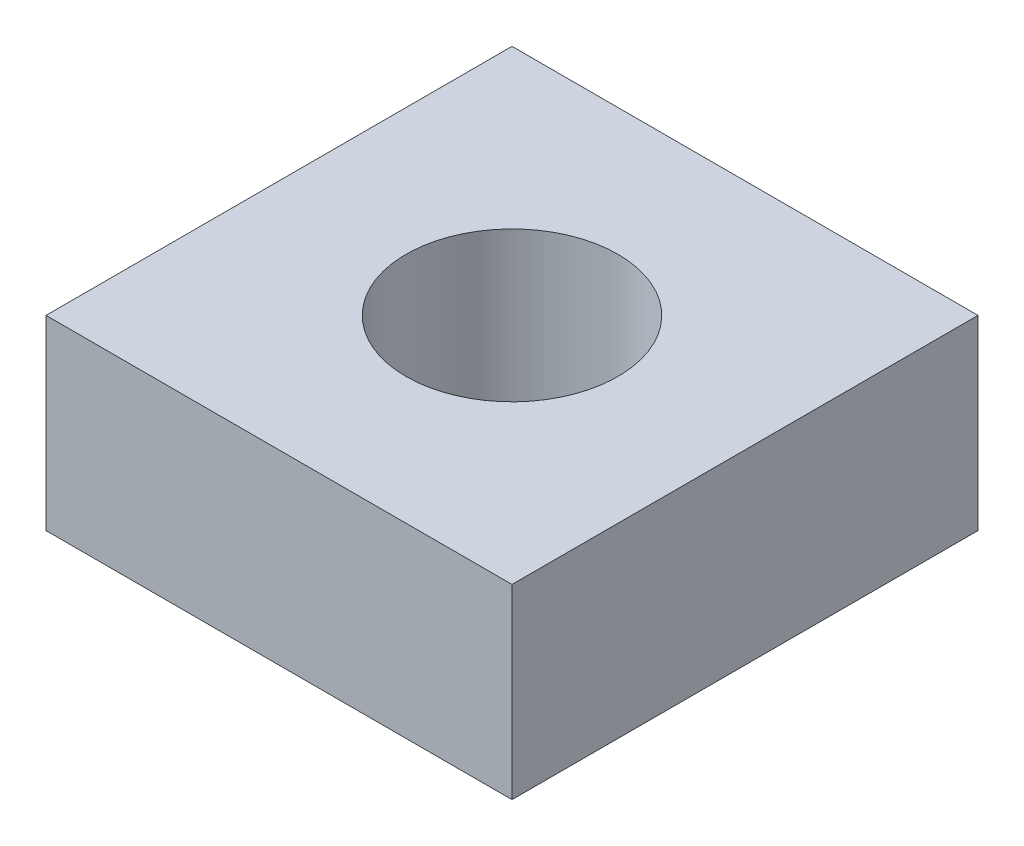
ISO-10303-21;
HEADER;
FILE_DESCRIPTION(('STEP AP214'),'2;1');
FILE_NAME('part.step','',(''),(''),'','','');
FILE_SCHEMA(('AUTOMOTIVE_DESIGN { 1 0 10303 214 1 1 1 1 }'));
ENDSEC;
DATA;
#1=APPLICATION_CONTEXT('core data for automotive mechanical design processes');
#2=APPLICATION_PROTOCOL_DEFINITION('international standard','automotive_design',2000,#1);
#3=PRODUCT_CONTEXT('',#1,'mechanical');
#4=PRODUCT('Part','Part','',(#3));
#5=PRODUCT_RELATED_PRODUCT_CATEGORY('part','',(#4));
#6=PRODUCT_DEFINITION_FORMATION('','',#4);
#7=PRODUCT_DEFINITION_CONTEXT('part definition',#1,'design');
#8=PRODUCT_DEFINITION('design','',#6,#7);
#9=PRODUCT_DEFINITION_SHAPE('','',#8);
#10=(LENGTH_UNIT() NAMED_UNIT(*) SI_UNIT(.MILLI.,.METRE.));
#11=(NAMED_UNIT(*) PLANE_ANGLE_UNIT() SI_UNIT($,.RADIAN.));
#12=(NAMED_UNIT(*) SI_UNIT($,.STERADIAN.) SOLID_ANGLE_UNIT());
#13=UNCERTAINTY_MEASURE_WITH_UNIT(LENGTH_MEASURE(1.E-05),#10,'distance_accuracy_value','');
#14=(GEOMETRIC_REPRESENTATION_CONTEXT(3) GLOBAL_UNCERTAINTY_ASSIGNED_CONTEXT((#13)) GLOBAL_UNIT_ASSIGNED_CONTEXT((#10,
#11,#12)) REPRESENTATION_CONTEXT('',''));
#15=CARTESIAN_POINT('',(0.,0.,0.));
#16=DIRECTION('',(0.,0.,1.));
#17=DIRECTION('',(1.,0.,0.));
#18=AXIS2_PLACEMENT_3D('',#15,#16,#17);
#19=CARTESIAN_POINT('',(2.75,2.2,-2.75));
#20=DIRECTION('',(-1.,0.,0.));
#21=DIRECTION('',(0.,0.,1.));
#22=AXIS2_PLACEMENT_3D('',#19,#20,#21);
#23=PLANE('',#22);
#24=DIRECTION('',(0.,0.,-1.));
#25=VECTOR('',#24,1.);
#26=CARTESIAN_POINT('',(2.75,0.,-2.75));
#27=LINE('',#26,#25);
#28=CARTESIAN_POINT('',(2.75,0.,2.75));
#29=VERTEX_POINT('',#28);
#30=CARTESIAN_POINT('',(2.75,0.,-2.75));
#31=VERTEX_POINT('',#30);
#32=EDGE_CURVE('E110',#29,#31,#27,.T.);
#33=ORIENTED_EDGE('',*,*,#32,.T.);
#34=DIRECTION('',(0.,-1.,0.));
#35=VECTOR('',#34,1.);
#36=CARTESIAN_POINT('',(2.75,2.2,-2.75));
#37=LINE('',#36,#35);
#38=CARTESIAN_POINT('',(2.75,2.2,-2.75));
#39=VERTEX_POINT('',#38);
#40=EDGE_CURVE('E11',#39,#31,#37,.T.);
#41=ORIENTED_EDGE('',*,*,#40,.F.);
#42=DIRECTION('',(0.,0.,-1.));
#43=VECTOR('',#42,1.);
#44=CARTESIAN_POINT('',(2.75,2.2,-2.75));
#45=LINE('',#44,#43);
#46=CARTESIAN_POINT('',(2.75,2.2,2.75));
#47=VERTEX_POINT('',#46);
#48=EDGE_CURVE('E98',#47,#39,#45,.T.);
#49=ORIENTED_EDGE('',*,*,#48,.F.);
#50=DIRECTION('',(0.,-1.,0.));
#51=VECTOR('',#50,1.);
#52=CARTESIAN_POINT('',(2.75,2.2,2.75));
#53=LINE('',#52,#51);
#54=EDGE_CURVE('E106',#47,#29,#53,.T.);
#55=ORIENTED_EDGE('',*,*,#54,.T.);
#56=EDGE_LOOP('',(#33,#41,#49,#55));
#57=FACE_BOUND('',#56,.T.);
#58=ADVANCED_FACE('F47',(#57),#23,.F.);
#59=CARTESIAN_POINT('',(-2.75,2.2,-2.75));
#60=DIRECTION('',(0.,0.,1.));
#61=DIRECTION('',(1.,0.,0.));
#62=AXIS2_PLACEMENT_3D('',#59,#60,#61);
#63=PLANE('',#62);
#64=DIRECTION('',(-1.,0.,0.));
#65=VECTOR('',#64,1.);
#66=CARTESIAN_POINT('',(-2.75,0.,-2.75));
#67=LINE('',#66,#65);
#68=CARTESIAN_POINT('',(-2.75,0.,-2.75));
#69=VERTEX_POINT('',#68);
#70=EDGE_CURVE('E102',#31,#69,#67,.T.);
#71=ORIENTED_EDGE('',*,*,#70,.T.);
#72=DIRECTION('',(0.,-1.,0.));
#73=VECTOR('',#72,1.);
#74=CARTESIAN_POINT('',(-2.75,2.2,-2.75));
#75=LINE('',#74,#73);
#76=CARTESIAN_POINT('',(-2.75,2.2,-2.75));
#77=VERTEX_POINT('',#76);
#78=EDGE_CURVE('E55',#77,#69,#75,.T.);
#79=ORIENTED_EDGE('',*,*,#78,.F.);
#80=DIRECTION('',(-1.,0.,0.));
#81=VECTOR('',#80,1.);
#82=CARTESIAN_POINT('',(-2.75,2.2,-2.75));
#83=LINE('',#82,#81);
#84=EDGE_CURVE('E93',#39,#77,#83,.T.);
#85=ORIENTED_EDGE('',*,*,#84,.F.);
#86=ORIENTED_EDGE('',*,*,#40,.T.);
#87=EDGE_LOOP('',(#71,#79,#85,#86));
#88=FACE_BOUND('',#87,.T.);
#89=ADVANCED_FACE('F101',(#88),#63,.F.);
#90=CARTESIAN_POINT('',(-2.75,2.2,-2.75));
#91=DIRECTION('',(1.,0.,0.));
#92=DIRECTION('',(0.,0.,-1.));
#93=AXIS2_PLACEMENT_3D('',#90,#91,#92);
#94=PLANE('',#93);
#95=DIRECTION('',(0.,0.,1.));
#96=VECTOR('',#95,1.);
#97=CARTESIAN_POINT('',(-2.75,0.,-2.75));
#98=LINE('',#97,#96);
#99=CARTESIAN_POINT('',(-2.75,0.,2.75));
#100=VERTEX_POINT('',#99);
#101=EDGE_CURVE('E80',#69,#100,#98,.T.);
#102=ORIENTED_EDGE('',*,*,#101,.T.);
#103=DIRECTION('',(0.,-1.,0.));
#104=VECTOR('',#103,1.);
#105=CARTESIAN_POINT('',(-2.75,2.2,2.75));
#106=LINE('',#105,#104);
#107=CARTESIAN_POINT('',(-2.75,2.2,2.75));
#108=VERTEX_POINT('',#107);
#109=EDGE_CURVE('E103',#108,#100,#106,.T.);
#110=ORIENTED_EDGE('',*,*,#109,.F.);
#111=DIRECTION('',(0.,0.,1.));
#112=VECTOR('',#111,1.);
#113=CARTESIAN_POINT('',(-2.75,2.2,-2.75));
#114=LINE('',#113,#112);
#115=EDGE_CURVE('E96',#77,#108,#114,.T.);
#116=ORIENTED_EDGE('',*,*,#115,.F.);
#117=ORIENTED_EDGE('',*,*,#78,.T.);
#118=EDGE_LOOP('',(#102,#110,#116,#117));
#119=FACE_BOUND('',#118,.T.);
#120=ADVANCED_FACE('F104',(#119),#94,.F.);
#121=CARTESIAN_POINT('',(-2.75,2.2,2.75));
#122=DIRECTION('',(0.,0.,-1.));
#123=DIRECTION('',(-1.,0.,0.));
#124=AXIS2_PLACEMENT_3D('',#121,#122,#123);
#125=PLANE('',#124);
#126=DIRECTION('',(1.,0.,0.));
#127=VECTOR('',#126,1.);
#128=CARTESIAN_POINT('',(-2.75,0.,2.75));
#129=LINE('',#128,#127);
#130=EDGE_CURVE('E86',#100,#29,#129,.T.);
#131=ORIENTED_EDGE('',*,*,#130,.T.);
#132=ORIENTED_EDGE('',*,*,#54,.F.);
#133=DIRECTION('',(1.,0.,0.));
#134=VECTOR('',#133,1.);
#135=CARTESIAN_POINT('',(-2.75,2.2,2.75));
#136=LINE('',#135,#134);
#137=EDGE_CURVE('E63',#108,#47,#136,.T.);
#138=ORIENTED_EDGE('',*,*,#137,.F.);
#139=ORIENTED_EDGE('',*,*,#109,.T.);
#140=EDGE_LOOP('',(#131,#132,#138,#139));
#141=FACE_BOUND('',#140,.T.);
#142=ADVANCED_FACE('F118',(#141),#125,.F.);
#143=CARTESIAN_POINT('',(0.,2.2,0.));
#144=DIRECTION('',(0.,1.,0.));
#145=DIRECTION('',(0.,0.,1.));
#146=AXIS2_PLACEMENT_3D('',#143,#144,#145);
#147=PLANE('',#146);
#148=CARTESIAN_POINT('',(0.,2.2,0.));
#149=DIRECTION('',(0.,1.,0.));
#150=DIRECTION('',(0.,0.,1.));
#151=AXIS2_PLACEMENT_3D('',#148,#149,#150);
#152=CIRCLE('',#151,1.24999999999999);
#153=CARTESIAN_POINT('',(0.,2.2,1.24999999999999));
#154=VERTEX_POINT('',#153);
#155=EDGE_CURVE('E126',#154,#154,#152,.T.);
#156=ORIENTED_EDGE('',*,*,#155,.F.);
#157=EDGE_LOOP('',(#156));
#158=FACE_BOUND('',#157,.T.);
#159=ORIENTED_EDGE('',*,*,#48,.T.);
#160=ORIENTED_EDGE('',*,*,#84,.T.);
#161=ORIENTED_EDGE('',*,*,#115,.T.);
#162=ORIENTED_EDGE('',*,*,#137,.T.);
#163=EDGE_LOOP('',(#159,#160,#161,#162));
#164=FACE_BOUND('',#163,.T.);
#165=ADVANCED_FACE('F94',(#158,#164),#147,.T.);
#166=CARTESIAN_POINT('',(0.,0.,0.));
#167=DIRECTION('',(0.,1.,0.));
#168=DIRECTION('',(0.,0.,1.));
#169=AXIS2_PLACEMENT_3D('',#166,#167,#168);
#170=PLANE('',#169);
#171=CARTESIAN_POINT('',(0.,0.,0.));
#172=DIRECTION('',(0.,1.,0.));
#173=DIRECTION('',(0.,0.,1.));
#174=AXIS2_PLACEMENT_3D('',#171,#172,#173);
#175=CIRCLE('',#174,1.25);
#176=CARTESIAN_POINT('',(0.,0.,1.25));
#177=VERTEX_POINT('',#176);
#178=EDGE_CURVE('E113',#177,#177,#175,.T.);
#179=ORIENTED_EDGE('',*,*,#178,.T.);
#180=EDGE_LOOP('',(#179));
#181=FACE_BOUND('',#180,.T.);
#182=ORIENTED_EDGE('',*,*,#32,.F.);
#183=ORIENTED_EDGE('',*,*,#130,.F.);
#184=ORIENTED_EDGE('',*,*,#101,.F.);
#185=ORIENTED_EDGE('',*,*,#70,.F.);
#186=EDGE_LOOP('',(#182,#183,#184,#185));
#187=FACE_BOUND('',#186,.T.);
#188=ADVANCED_FACE('F121',(#181,#187),#170,.F.);
#189=CARTESIAN_POINT('',(0.,2.2,0.));
#190=DIRECTION('',(0.,1.,0.));
#191=DIRECTION('',(0.,0.,1.));
#192=AXIS2_PLACEMENT_3D('',#189,#190,#191);
#193=CYLINDRICAL_SURFACE('',#192,1.24999999999999);
#194=ORIENTED_EDGE('',*,*,#178,.F.);
#195=EDGE_LOOP('',(#194));
#196=FACE_BOUND('',#195,.T.);
#197=ORIENTED_EDGE('',*,*,#155,.T.);
#198=EDGE_LOOP('',(#197));
#199=FACE_BOUND('',#198,.T.);
#200=ADVANCED_FACE('F130',(#196,#199),#193,.F.);
#201=CLOSED_SHELL('',(#58,#89,#120,#142,#165,#188,#200));
#202=MANIFOLD_SOLID_BREP('B2',#201);
#203=ADVANCED_BREP_SHAPE_REPRESENTATION('',(#18,#202),#14);
#204=SHAPE_DEFINITION_REPRESENTATION(#9,#203);
ENDSEC;
END-ISO-10303-21;
